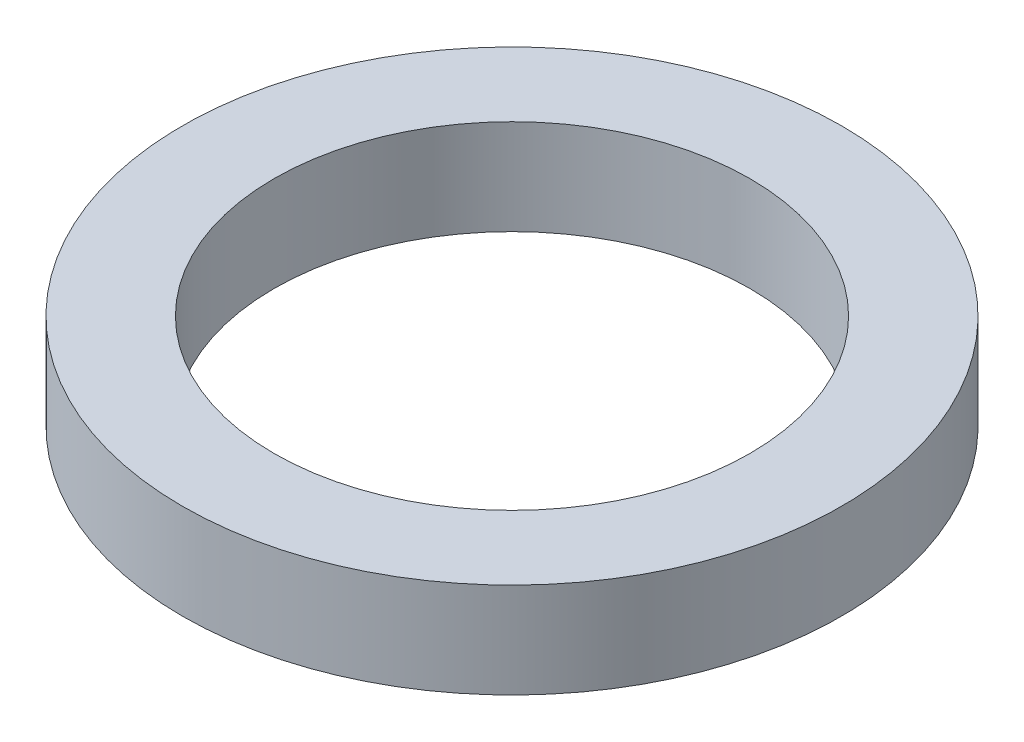
ISO-10303-21;
HEADER;
FILE_DESCRIPTION(('STEP AP214'),'2;1');
FILE_NAME('part.step','',(''),(''),'','','');
FILE_SCHEMA(('AUTOMOTIVE_DESIGN { 1 0 10303 214 1 1 1 1 }'));
ENDSEC;
DATA;
#1=APPLICATION_CONTEXT('core data for automotive mechanical design processes');
#2=APPLICATION_PROTOCOL_DEFINITION('international standard','automotive_design',2000,#1);
#3=PRODUCT_CONTEXT('',#1,'mechanical');
#4=PRODUCT('Part','Part','',(#3));
#5=PRODUCT_RELATED_PRODUCT_CATEGORY('part','',(#4));
#6=PRODUCT_DEFINITION_FORMATION('','',#4);
#7=PRODUCT_DEFINITION_CONTEXT('part definition',#1,'design');
#8=PRODUCT_DEFINITION('design','',#6,#7);
#9=PRODUCT_DEFINITION_SHAPE('','',#8);
#10=(LENGTH_UNIT() NAMED_UNIT(*) SI_UNIT(.MILLI.,.METRE.));
#11=(NAMED_UNIT(*) PLANE_ANGLE_UNIT() SI_UNIT($,.RADIAN.));
#12=(NAMED_UNIT(*) SI_UNIT($,.STERADIAN.) SOLID_ANGLE_UNIT());
#13=UNCERTAINTY_MEASURE_WITH_UNIT(LENGTH_MEASURE(1.E-05),#10,'distance_accuracy_value','');
#14=(GEOMETRIC_REPRESENTATION_CONTEXT(3) GLOBAL_UNCERTAINTY_ASSIGNED_CONTEXT((#13)) GLOBAL_UNIT_ASSIGNED_CONTEXT((#10,
#11,#12)) REPRESENTATION_CONTEXT('',''));
#15=CARTESIAN_POINT('',(0.,0.,0.));
#16=DIRECTION('',(0.,0.,1.));
#17=DIRECTION('',(1.,0.,0.));
#18=AXIS2_PLACEMENT_3D('',#15,#16,#17);
#19=CARTESIAN_POINT('',(0.,13.,0.));
#20=DIRECTION('',(0.,-1.,0.));
#21=DIRECTION('',(0.,0.,-1.));
#22=AXIS2_PLACEMENT_3D('',#19,#20,#21);
#23=CYLINDRICAL_SURFACE('',#22,45.);
#24=CARTESIAN_POINT('',(0.,13.,0.));
#25=DIRECTION('',(0.,1.,0.));
#26=DIRECTION('',(0.,0.,1.));
#27=AXIS2_PLACEMENT_3D('',#24,#25,#26);
#28=CIRCLE('',#27,45.);
#29=CARTESIAN_POINT('',(0.,13.,-45.));
#30=VERTEX_POINT('',#29);
#31=EDGE_CURVE('E10',#30,#30,#28,.T.);
#32=CARTESIAN_POINT('',(0.,0.,0.));
#33=DIRECTION('',(0.,1.,0.));
#34=DIRECTION('',(0.,0.,1.));
#35=AXIS2_PLACEMENT_3D('',#32,#33,#34);
#36=CIRCLE('',#35,45.);
#37=CARTESIAN_POINT('',(0.,0.,-45.));
#38=VERTEX_POINT('',#37);
#39=EDGE_CURVE('E37',#38,#38,#36,.T.);
#40=CARTESIAN_POINT('',(0.,13.,-45.));
#41=CARTESIAN_POINT('',(0.,12.8645833333333,-45.));
#42=CARTESIAN_POINT('',(0.,12.7291666666667,-45.));
#43=CARTESIAN_POINT('',(0.,12.4583333333333,-45.));
#44=CARTESIAN_POINT('',(0.,12.3229166666667,-45.));
#45=CARTESIAN_POINT('',(0.,12.0520833333333,-45.));
#46=CARTESIAN_POINT('',(0.,11.9166666666667,-45.));
#47=CARTESIAN_POINT('',(0.,11.6458333333333,-45.));
#48=CARTESIAN_POINT('',(0.,11.5104166666667,-45.));
#49=CARTESIAN_POINT('',(0.,11.2395833333333,-45.));
#50=CARTESIAN_POINT('',(0.,11.1041666666667,-45.));
#51=CARTESIAN_POINT('',(0.,10.8333333333333,-45.));
#52=CARTESIAN_POINT('',(0.,10.6979166666667,-45.));
#53=CARTESIAN_POINT('',(0.,10.4270833333333,-45.));
#54=CARTESIAN_POINT('',(0.,10.2916666666667,-45.));
#55=CARTESIAN_POINT('',(0.,10.0208333333333,-45.));
#56=CARTESIAN_POINT('',(0.,9.88541666666667,-45.));
#57=CARTESIAN_POINT('',(0.,9.61458333333333,-45.));
#58=CARTESIAN_POINT('',(0.,9.47916666666667,-45.));
#59=CARTESIAN_POINT('',(0.,9.20833333333333,-45.));
#60=CARTESIAN_POINT('',(0.,9.07291666666666,-45.));
#61=CARTESIAN_POINT('',(0.,8.80208333333333,-45.));
#62=CARTESIAN_POINT('',(0.,8.66666666666667,-45.));
#63=CARTESIAN_POINT('',(0.,8.39583333333333,-45.));
#64=CARTESIAN_POINT('',(0.,8.26041666666667,-45.));
#65=CARTESIAN_POINT('',(0.,7.98958333333333,-45.));
#66=CARTESIAN_POINT('',(0.,7.85416666666667,-45.));
#67=CARTESIAN_POINT('',(0.,7.58333333333333,-45.));
#68=CARTESIAN_POINT('',(0.,7.44791666666667,-45.));
#69=CARTESIAN_POINT('',(0.,7.17708333333333,-45.));
#70=CARTESIAN_POINT('',(0.,7.04166666666667,-45.));
#71=CARTESIAN_POINT('',(0.,6.77083333333333,-45.));
#72=CARTESIAN_POINT('',(0.,6.63541666666667,-45.));
#73=CARTESIAN_POINT('',(0.,6.36458333333333,-45.));
#74=CARTESIAN_POINT('',(0.,6.22916666666667,-45.));
#75=CARTESIAN_POINT('',(0.,5.95833333333333,-45.));
#76=CARTESIAN_POINT('',(0.,5.82291666666667,-45.));
#77=CARTESIAN_POINT('',(0.,5.55208333333333,-45.));
#78=CARTESIAN_POINT('',(0.,5.41666666666667,-45.));
#79=CARTESIAN_POINT('',(0.,5.14583333333333,-45.));
#80=CARTESIAN_POINT('',(0.,5.01041666666667,-45.));
#81=CARTESIAN_POINT('',(0.,4.73958333333333,-45.));
#82=CARTESIAN_POINT('',(0.,4.60416666666667,-45.));
#83=CARTESIAN_POINT('',(0.,4.33333333333333,-45.));
#84=CARTESIAN_POINT('',(0.,4.19791666666667,-45.));
#85=CARTESIAN_POINT('',(0.,3.92708333333333,-45.));
#86=CARTESIAN_POINT('',(0.,3.79166666666667,-45.));
#87=CARTESIAN_POINT('',(0.,3.52083333333333,-45.));
#88=CARTESIAN_POINT('',(0.,3.38541666666667,-45.));
#89=CARTESIAN_POINT('',(0.,3.11458333333333,-45.));
#90=CARTESIAN_POINT('',(0.,2.97916666666667,-45.));
#91=CARTESIAN_POINT('',(0.,2.70833333333333,-45.));
#92=CARTESIAN_POINT('',(0.,2.57291666666667,-45.));
#93=CARTESIAN_POINT('',(0.,2.30208333333333,-45.));
#94=CARTESIAN_POINT('',(0.,2.16666666666667,-45.));
#95=CARTESIAN_POINT('',(0.,1.89583333333333,-45.));
#96=CARTESIAN_POINT('',(0.,1.76041666666667,-45.));
#97=CARTESIAN_POINT('',(0.,1.48958333333333,-45.));
#98=CARTESIAN_POINT('',(0.,1.35416666666667,-45.));
#99=CARTESIAN_POINT('',(0.,1.08333333333333,-45.));
#100=CARTESIAN_POINT('',(0.,0.947916666666667,-45.));
#101=CARTESIAN_POINT('',(0.,0.677083333333334,-45.));
#102=CARTESIAN_POINT('',(0.,0.541666666666667,-45.));
#103=CARTESIAN_POINT('',(0.,0.270833333333334,-45.));
#104=CARTESIAN_POINT('',(0.,0.135416666666667,-45.));
#105=CARTESIAN_POINT('',(0.,0.,-45.));
#106=B_SPLINE_CURVE_WITH_KNOTS('',3,(#40,#41,#42,#43,#44,#45,#46,#47,#48,#49,#50,#51,#52,#53,
#54,#55,#56,#57,#58,#59,#60,#61,#62,#63,#64,#65,#66,#67,#68,#69,#70,#71,#72,#73,#74,#75,#76,#77,
#78,#79,#80,#81,#82,#83,#84,#85,#86,#87,#88,#89,#90,#91,#92,#93,#94,#95,#96,#97,#98,#99,#100,
#101,#102,#103,#104,#105),.UNSPECIFIED.,.F.,.F.,(4,2,2,2,2,2,2,2,2,2,2,2,2,2,2,2,2,2,2,2,2,2,2,
2,2,2,2,2,2,2,2,2,4),(0.,0.40625,0.812500000000001,1.21875,1.625,2.03125,2.4375,2.84375,3.25,
3.65625,4.0625,4.46875,4.875,5.28125,5.6875,6.09375,6.5,6.90625,7.3125,7.71875,8.125,8.53125,
8.9375,9.34375,9.75,10.15625,10.5625,10.96875,11.375,11.78125,12.1875,12.59375,13.),.UNSPECIFIED.);
#107=EDGE_CURVE('BSEAM40',#30,#38,#106,.T.);
#108=ORIENTED_EDGE('',*,*,#31,.F.);
#109=ORIENTED_EDGE('',*,*,#39,.T.);
#110=ORIENTED_EDGE('',*,*,#107,.T.);
#111=ORIENTED_EDGE('',*,*,#107,.F.);
#112=EDGE_LOOP('',(#108,#110,#109,#111));
#113=FACE_BOUND('',#112,.T.);
#114=ADVANCED_FACE('F40',(#113),#23,.T.);
#115=CARTESIAN_POINT('',(0.,13.,0.));
#116=DIRECTION('',(0.,1.,0.));
#117=DIRECTION('',(0.,0.,1.));
#118=AXIS2_PLACEMENT_3D('',#115,#116,#117);
#119=PLANE('',#118);
#120=CARTESIAN_POINT('',(0.,13.,0.));
#121=DIRECTION('',(0.,1.,0.));
#122=DIRECTION('',(0.,0.,1.));
#123=AXIS2_PLACEMENT_3D('',#120,#121,#122);
#124=CIRCLE('',#123,32.5);
#125=CARTESIAN_POINT('',(0.,13.,-32.5));
#126=VERTEX_POINT('',#125);
#127=EDGE_CURVE('E50',#126,#126,#124,.T.);
#128=ORIENTED_EDGE('',*,*,#127,.F.);
#129=EDGE_LOOP('',(#128));
#130=FACE_BOUND('',#129,.T.);
#131=ORIENTED_EDGE('',*,*,#31,.T.);
#132=EDGE_LOOP('',(#131));
#133=FACE_BOUND('',#132,.T.);
#134=ADVANCED_FACE('F59',(#130,#133),#119,.T.);
#135=CARTESIAN_POINT('',(0.,0.,0.));
#136=DIRECTION('',(0.,1.,0.));
#137=DIRECTION('',(0.,0.,1.));
#138=AXIS2_PLACEMENT_3D('',#135,#136,#137);
#139=PLANE('',#138);
#140=CARTESIAN_POINT('',(0.,0.,0.));
#141=DIRECTION('',(0.,1.,0.));
#142=DIRECTION('',(0.,0.,1.));
#143=AXIS2_PLACEMENT_3D('',#140,#141,#142);
#144=CIRCLE('',#143,32.5);
#145=CARTESIAN_POINT('',(0.,0.,-32.5));
#146=VERTEX_POINT('',#145);
#147=EDGE_CURVE('E47',#146,#146,#144,.T.);
#148=ORIENTED_EDGE('',*,*,#147,.T.);
#149=EDGE_LOOP('',(#148));
#150=FACE_BOUND('',#149,.T.);
#151=ORIENTED_EDGE('',*,*,#39,.F.);
#152=EDGE_LOOP('',(#151));
#153=FACE_BOUND('',#152,.T.);
#154=ADVANCED_FACE('F58',(#150,#153),#139,.F.);
#155=CARTESIAN_POINT('',(0.,13.,0.));
#156=DIRECTION('',(0.,-1.,0.));
#157=DIRECTION('',(0.,0.,-1.));
#158=AXIS2_PLACEMENT_3D('',#155,#156,#157);
#159=CYLINDRICAL_SURFACE('',#158,32.5);
#160=CARTESIAN_POINT('',(0.,13.,-32.5));
#161=CARTESIAN_POINT('',(0.,12.8645833333333,-32.5));
#162=CARTESIAN_POINT('',(0.,12.7291666666667,-32.5));
#163=CARTESIAN_POINT('',(0.,12.4583333333333,-32.5));
#164=CARTESIAN_POINT('',(0.,12.3229166666667,-32.5));
#165=CARTESIAN_POINT('',(0.,12.0520833333333,-32.5));
#166=CARTESIAN_POINT('',(0.,11.9166666666667,-32.5));
#167=CARTESIAN_POINT('',(0.,11.6458333333333,-32.5));
#168=CARTESIAN_POINT('',(0.,11.5104166666667,-32.5));
#169=CARTESIAN_POINT('',(0.,11.2395833333333,-32.5));
#170=CARTESIAN_POINT('',(0.,11.1041666666667,-32.5));
#171=CARTESIAN_POINT('',(0.,10.8333333333333,-32.5));
#172=CARTESIAN_POINT('',(0.,10.6979166666667,-32.5));
#173=CARTESIAN_POINT('',(0.,10.4270833333333,-32.5));
#174=CARTESIAN_POINT('',(0.,10.2916666666667,-32.5));
#175=CARTESIAN_POINT('',(0.,10.0208333333333,-32.5));
#176=CARTESIAN_POINT('',(0.,9.88541666666667,-32.5));
#177=CARTESIAN_POINT('',(0.,9.61458333333333,-32.5));
#178=CARTESIAN_POINT('',(0.,9.47916666666667,-32.5));
#179=CARTESIAN_POINT('',(0.,9.20833333333333,-32.5));
#180=CARTESIAN_POINT('',(0.,9.07291666666667,-32.5));
#181=CARTESIAN_POINT('',(0.,8.80208333333333,-32.5));
#182=CARTESIAN_POINT('',(0.,8.66666666666667,-32.5));
#183=CARTESIAN_POINT('',(0.,8.39583333333333,-32.5));
#184=CARTESIAN_POINT('',(0.,8.26041666666667,-32.5));
#185=CARTESIAN_POINT('',(0.,7.98958333333333,-32.5));
#186=CARTESIAN_POINT('',(0.,7.85416666666667,-32.5));
#187=CARTESIAN_POINT('',(0.,7.58333333333333,-32.5));
#188=CARTESIAN_POINT('',(0.,7.44791666666667,-32.5));
#189=CARTESIAN_POINT('',(0.,7.17708333333333,-32.5));
#190=CARTESIAN_POINT('',(0.,7.04166666666667,-32.5));
#191=CARTESIAN_POINT('',(0.,6.77083333333333,-32.5));
#192=CARTESIAN_POINT('',(0.,6.63541666666667,-32.5));
#193=CARTESIAN_POINT('',(0.,6.36458333333333,-32.5));
#194=CARTESIAN_POINT('',(0.,6.22916666666667,-32.5));
#195=CARTESIAN_POINT('',(0.,5.95833333333333,-32.5));
#196=CARTESIAN_POINT('',(0.,5.82291666666667,-32.5));
#197=CARTESIAN_POINT('',(0.,5.55208333333333,-32.5));
#198=CARTESIAN_POINT('',(0.,5.41666666666667,-32.5));
#199=CARTESIAN_POINT('',(0.,5.14583333333333,-32.5));
#200=CARTESIAN_POINT('',(0.,5.01041666666667,-32.5));
#201=CARTESIAN_POINT('',(0.,4.73958333333333,-32.5));
#202=CARTESIAN_POINT('',(0.,4.60416666666667,-32.5));
#203=CARTESIAN_POINT('',(0.,4.33333333333333,-32.5));
#204=CARTESIAN_POINT('',(0.,4.19791666666667,-32.5));
#205=CARTESIAN_POINT('',(0.,3.92708333333333,-32.5));
#206=CARTESIAN_POINT('',(0.,3.79166666666667,-32.5));
#207=CARTESIAN_POINT('',(0.,3.52083333333333,-32.5));
#208=CARTESIAN_POINT('',(0.,3.38541666666667,-32.5));
#209=CARTESIAN_POINT('',(0.,3.11458333333333,-32.5));
#210=CARTESIAN_POINT('',(0.,2.97916666666667,-32.5));
#211=CARTESIAN_POINT('',(0.,2.70833333333333,-32.5));
#212=CARTESIAN_POINT('',(0.,2.57291666666667,-32.5));
#213=CARTESIAN_POINT('',(0.,2.30208333333333,-32.5));
#214=CARTESIAN_POINT('',(0.,2.16666666666667,-32.5));
#215=CARTESIAN_POINT('',(0.,1.89583333333333,-32.5));
#216=CARTESIAN_POINT('',(0.,1.76041666666667,-32.5));
#217=CARTESIAN_POINT('',(0.,1.48958333333333,-32.5));
#218=CARTESIAN_POINT('',(0.,1.35416666666667,-32.5));
#219=CARTESIAN_POINT('',(0.,1.08333333333333,-32.5));
#220=CARTESIAN_POINT('',(0.,0.947916666666667,-32.5));
#221=CARTESIAN_POINT('',(0.,0.677083333333334,-32.5));
#222=CARTESIAN_POINT('',(0.,0.541666666666667,-32.5));
#223=CARTESIAN_POINT('',(0.,0.270833333333334,-32.5));
#224=CARTESIAN_POINT('',(0.,0.135416666666667,-32.5));
#225=CARTESIAN_POINT('',(0.,0.,-32.5));
#226=B_SPLINE_CURVE_WITH_KNOTS('',3,(#160,#161,#162,#163,#164,#165,#166,#167,#168,#169,#170,
#171,#172,#173,#174,#175,#176,#177,#178,#179,#180,#181,#182,#183,#184,#185,#186,#187,#188,#189,
#190,#191,#192,#193,#194,#195,#196,#197,#198,#199,#200,#201,#202,#203,#204,#205,#206,#207,#208,
#209,#210,#211,#212,#213,#214,#215,#216,#217,#218,#219,#220,#221,#222,#223,#224,#225),
.UNSPECIFIED.,.F.,.F.,(4,2,2,2,2,2,2,2,2,2,2,2,2,2,2,2,2,2,2,2,2,2,2,2,2,2,2,2,2,2,2,2,4),(0.,
0.406249999999999,0.812499999999999,1.21875,1.625,2.03125,2.4375,2.84375,3.25,3.65625,4.0625,
4.46875,4.875,5.28125,5.6875,6.09375,6.5,6.90625,7.3125,7.71875,8.125,8.53125,8.9375,9.34375,
9.75,10.15625,10.5625,10.96875,11.375,11.78125,12.1875,12.59375,13.),.UNSPECIFIED.);
#227=EDGE_CURVE('BSEAM54',#126,#146,#226,.T.);
#228=ORIENTED_EDGE('',*,*,#127,.T.);
#229=ORIENTED_EDGE('',*,*,#147,.F.);
#230=ORIENTED_EDGE('',*,*,#227,.T.);
#231=ORIENTED_EDGE('',*,*,#227,.F.);
#232=EDGE_LOOP('',(#228,#230,#229,#231));
#233=FACE_BOUND('',#232,.T.);
#234=ADVANCED_FACE('F54',(#233),#159,.F.);
#235=CLOSED_SHELL('',(#114,#134,#154,#234));
#236=MANIFOLD_SOLID_BREP('B2',#235);
#237=ADVANCED_BREP_SHAPE_REPRESENTATION('',(#18,#236),#14);
#238=SHAPE_DEFINITION_REPRESENTATION(#9,#237);
ENDSEC;
END-ISO-10303-21;
